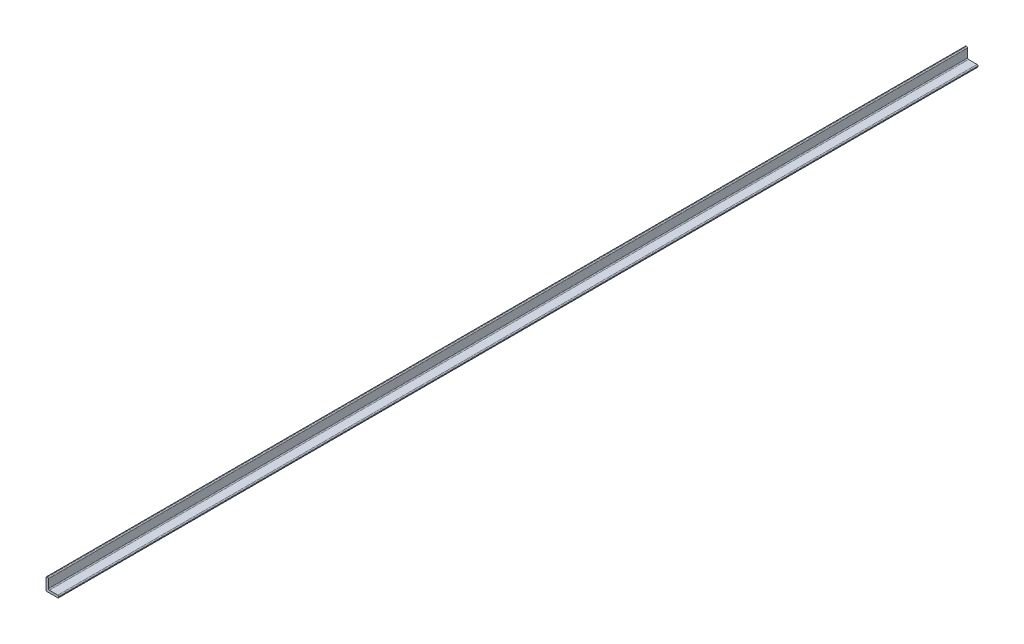
ISO-10303-21;
HEADER;
FILE_DESCRIPTION(('STEP AP214'),'2;1');
FILE_NAME('part.step','',(''),(''),'','','');
FILE_SCHEMA(('AUTOMOTIVE_DESIGN { 1 0 10303 214 1 1 1 1 }'));
ENDSEC;
DATA;
#1=APPLICATION_CONTEXT('core data for automotive mechanical design processes');
#2=APPLICATION_PROTOCOL_DEFINITION('international standard','automotive_design',2000,#1);
#3=PRODUCT_CONTEXT('',#1,'mechanical');
#4=PRODUCT('Part','Part','',(#3));
#5=PRODUCT_RELATED_PRODUCT_CATEGORY('part','',(#4));
#6=PRODUCT_DEFINITION_FORMATION('','',#4);
#7=PRODUCT_DEFINITION_CONTEXT('part definition',#1,'design');
#8=PRODUCT_DEFINITION('design','',#6,#7);
#9=PRODUCT_DEFINITION_SHAPE('','',#8);
#10=(LENGTH_UNIT() NAMED_UNIT(*) SI_UNIT(.MILLI.,.METRE.));
#11=(NAMED_UNIT(*) PLANE_ANGLE_UNIT() SI_UNIT($,.RADIAN.));
#12=(NAMED_UNIT(*) SI_UNIT($,.STERADIAN.) SOLID_ANGLE_UNIT());
#13=UNCERTAINTY_MEASURE_WITH_UNIT(LENGTH_MEASURE(1.E-05),#10,'distance_accuracy_value','');
#14=(GEOMETRIC_REPRESENTATION_CONTEXT(3) GLOBAL_UNCERTAINTY_ASSIGNED_CONTEXT((#13)) GLOBAL_UNIT_ASSIGNED_CONTEXT((#10,
#11,#12)) REPRESENTATION_CONTEXT('',''));
#15=CARTESIAN_POINT('',(0.,0.,0.));
#16=DIRECTION('',(0.,0.,1.));
#17=DIRECTION('',(1.,0.,0.));
#18=AXIS2_PLACEMENT_3D('',#15,#16,#17);
#19=CARTESIAN_POINT('',(-7.9375,12.7,-914.4));
#20=DIRECTION('',(0.,1.,0.));
#21=DIRECTION('',(0.,0.,1.));
#22=AXIS2_PLACEMENT_3D('',#19,#20,#21);
#23=PLANE('',#22);
#24=DIRECTION('',(-1.,0.,0.));
#25=VECTOR('',#24,1.);
#26=CARTESIAN_POINT('',(-7.9375,12.7,-914.4));
#27=LINE('',#26,#25);
#28=CARTESIAN_POINT('',(-9.8425,12.7,-914.4));
#29=VERTEX_POINT('',#28);
#30=CARTESIAN_POINT('',(-10.795,12.7,-914.4));
#31=VERTEX_POINT('',#30);
#32=EDGE_CURVE('E155',#29,#31,#27,.T.);
#33=ORIENTED_EDGE('',*,*,#32,.T.);
#34=DIRECTION('',(0.,0.,1.));
#35=VECTOR('',#34,1.);
#36=CARTESIAN_POINT('',(-10.795,12.7,-914.4));
#37=LINE('',#36,#35);
#38=CARTESIAN_POINT('',(-10.795,12.7,914.4));
#39=VERTEX_POINT('',#38);
#40=EDGE_CURVE('E45',#31,#39,#37,.T.);
#41=ORIENTED_EDGE('',*,*,#40,.T.);
#42=DIRECTION('',(-1.,0.,0.));
#43=VECTOR('',#42,1.);
#44=CARTESIAN_POINT('',(-7.9375,12.7,914.4));
#45=LINE('',#44,#43);
#46=CARTESIAN_POINT('',(-9.8425,12.7,914.4));
#47=VERTEX_POINT('',#46);
#48=EDGE_CURVE('E215',#47,#39,#45,.T.);
#49=ORIENTED_EDGE('',*,*,#48,.F.);
#50=DIRECTION('',(0.,0.,1.));
#51=VECTOR('',#50,1.);
#52=CARTESIAN_POINT('',(-9.8425,12.7,-914.4));
#53=LINE('',#52,#51);
#54=EDGE_CURVE('E209',#47,#29,#53,.F.);
#55=ORIENTED_EDGE('',*,*,#54,.T.);
#56=EDGE_LOOP('',(#33,#41,#49,#55));
#57=FACE_BOUND('',#56,.T.);
#58=ADVANCED_FACE('F37',(#57),#23,.T.);
#59=CARTESIAN_POINT('',(-7.9375,-6.0325,-914.4));
#60=DIRECTION('',(1.,0.,0.));
#61=DIRECTION('',(0.,0.,-1.));
#62=AXIS2_PLACEMENT_3D('',#59,#60,#61);
#63=PLANE('',#62);
#64=DIRECTION('',(0.,1.,0.));
#65=VECTOR('',#64,1.);
#66=CARTESIAN_POINT('',(-7.9375,-6.0325,-914.4));
#67=LINE('',#66,#65);
#68=CARTESIAN_POINT('',(-7.9375,-6.0325,-914.4));
#69=VERTEX_POINT('',#68);
#70=CARTESIAN_POINT('',(-7.9375,10.795,-914.4));
#71=VERTEX_POINT('',#70);
#72=EDGE_CURVE('E150',#69,#71,#67,.T.);
#73=ORIENTED_EDGE('',*,*,#72,.T.);
#74=DIRECTION('',(0.,0.,1.));
#75=VECTOR('',#74,1.);
#76=CARTESIAN_POINT('',(-7.9375,10.795,-914.4));
#77=LINE('',#76,#75);
#78=CARTESIAN_POINT('',(-7.9375,10.795,914.4));
#79=VERTEX_POINT('',#78);
#80=EDGE_CURVE('E11',#71,#79,#77,.T.);
#81=ORIENTED_EDGE('',*,*,#80,.T.);
#82=DIRECTION('',(0.,1.,0.));
#83=VECTOR('',#82,1.);
#84=CARTESIAN_POINT('',(-7.9375,-6.0325,914.4));
#85=LINE('',#84,#83);
#86=CARTESIAN_POINT('',(-7.9375,-6.0325,914.4));
#87=VERTEX_POINT('',#86);
#88=EDGE_CURVE('E153',#87,#79,#85,.T.);
#89=ORIENTED_EDGE('',*,*,#88,.F.);
#90=DIRECTION('',(0.,0.,1.));
#91=VECTOR('',#90,1.);
#92=CARTESIAN_POINT('',(-7.9375,-6.0325,-914.4));
#93=LINE('',#92,#91);
#94=EDGE_CURVE('E149',#69,#87,#93,.T.);
#95=ORIENTED_EDGE('',*,*,#94,.F.);
#96=EDGE_LOOP('',(#73,#81,#89,#95));
#97=FACE_BOUND('',#96,.T.);
#98=ADVANCED_FACE('F253',(#97),#63,.T.);
#99=CARTESIAN_POINT('',(-6.0325,-6.0325,-914.4));
#100=DIRECTION('',(0.,0.,1.));
#101=DIRECTION('',(1.,0.,0.));
#102=AXIS2_PLACEMENT_3D('',#99,#100,#101);
#103=CYLINDRICAL_SURFACE('',#102,1.905);
#104=ORIENTED_EDGE('',*,*,#94,.T.);
#105=CARTESIAN_POINT('',(-6.0325,-6.0325,914.4));
#106=DIRECTION('',(0.,0.,-1.));
#107=DIRECTION('',(1.,0.,0.));
#108=AXIS2_PLACEMENT_3D('',#105,#106,#107);
#109=CIRCLE('',#108,1.905);
#110=CARTESIAN_POINT('',(-6.0325,-7.9375,914.4));
#111=VERTEX_POINT('',#110);
#112=EDGE_CURVE('E134',#111,#87,#109,.T.);
#113=ORIENTED_EDGE('',*,*,#112,.F.);
#114=DIRECTION('',(0.,0.,1.));
#115=VECTOR('',#114,1.);
#116=CARTESIAN_POINT('',(-6.0325,-7.9375,-914.4));
#117=LINE('',#116,#115);
#118=CARTESIAN_POINT('',(-6.0325,-7.9375,-914.4));
#119=VERTEX_POINT('',#118);
#120=EDGE_CURVE('E143',#119,#111,#117,.T.);
#121=ORIENTED_EDGE('',*,*,#120,.F.);
#122=CARTESIAN_POINT('',(-6.0325,-6.0325,-914.4));
#123=DIRECTION('',(0.,0.,-1.));
#124=DIRECTION('',(1.,0.,0.));
#125=AXIS2_PLACEMENT_3D('',#122,#123,#124);
#126=CIRCLE('',#125,1.905);
#127=EDGE_CURVE('E170',#119,#69,#126,.T.);
#128=ORIENTED_EDGE('',*,*,#127,.T.);
#129=EDGE_LOOP('',(#104,#113,#121,#128));
#130=FACE_BOUND('',#129,.T.);
#131=ADVANCED_FACE('F152',(#130),#103,.F.);
#132=CARTESIAN_POINT('',(12.7,-7.9375,-914.4));
#133=DIRECTION('',(0.,1.,0.));
#134=DIRECTION('',(0.,0.,1.));
#135=AXIS2_PLACEMENT_3D('',#132,#133,#134);
#136=PLANE('',#135);
#137=DIRECTION('',(-1.,0.,0.));
#138=VECTOR('',#137,1.);
#139=CARTESIAN_POINT('',(12.7,-7.9375,914.4));
#140=LINE('',#139,#138);
#141=CARTESIAN_POINT('',(10.795,-7.9375,914.4));
#142=VERTEX_POINT('',#141);
#143=EDGE_CURVE('E128',#142,#111,#140,.T.);
#144=ORIENTED_EDGE('',*,*,#143,.F.);
#145=DIRECTION('',(0.,0.,1.));
#146=VECTOR('',#145,1.);
#147=CARTESIAN_POINT('',(10.795,-7.9375,-914.4));
#148=LINE('',#147,#146);
#149=CARTESIAN_POINT('',(10.795,-7.9375,-914.4));
#150=VERTEX_POINT('',#149);
#151=EDGE_CURVE('E207',#142,#150,#148,.F.);
#152=ORIENTED_EDGE('',*,*,#151,.T.);
#153=DIRECTION('',(-1.,0.,0.));
#154=VECTOR('',#153,1.);
#155=CARTESIAN_POINT('',(12.7,-7.9375,-914.4));
#156=LINE('',#155,#154);
#157=EDGE_CURVE('E145',#150,#119,#156,.T.);
#158=ORIENTED_EDGE('',*,*,#157,.T.);
#159=ORIENTED_EDGE('',*,*,#120,.T.);
#160=EDGE_LOOP('',(#144,#152,#158,#159));
#161=FACE_BOUND('',#160,.T.);
#162=ADVANCED_FACE('F144',(#161),#136,.T.);
#163=CARTESIAN_POINT('',(12.7,-12.7,-914.4));
#164=DIRECTION('',(1.,0.,0.));
#165=DIRECTION('',(0.,1.,0.));
#166=AXIS2_PLACEMENT_3D('',#163,#164,#165);
#167=PLANE('',#166);
#168=DIRECTION('',(0.,1.,0.));
#169=VECTOR('',#168,1.);
#170=CARTESIAN_POINT('',(12.7,-12.7,914.4));
#171=LINE('',#170,#169);
#172=CARTESIAN_POINT('',(12.7,-10.795,914.4));
#173=VERTEX_POINT('',#172);
#174=CARTESIAN_POINT('',(12.7,-9.8425,914.4));
#175=VERTEX_POINT('',#174);
#176=EDGE_CURVE('E140',#173,#175,#171,.T.);
#177=ORIENTED_EDGE('',*,*,#176,.F.);
#178=DIRECTION('',(0.,0.,1.));
#179=VECTOR('',#178,1.);
#180=CARTESIAN_POINT('',(12.7,-10.795,-914.4));
#181=LINE('',#180,#179);
#182=CARTESIAN_POINT('',(12.7,-10.795,-914.4));
#183=VERTEX_POINT('',#182);
#184=EDGE_CURVE('E59',#173,#183,#181,.F.);
#185=ORIENTED_EDGE('',*,*,#184,.T.);
#186=DIRECTION('',(0.,1.,0.));
#187=VECTOR('',#186,1.);
#188=CARTESIAN_POINT('',(12.7,-12.7,-914.4));
#189=LINE('',#188,#187);
#190=CARTESIAN_POINT('',(12.7,-9.8425,-914.4));
#191=VERTEX_POINT('',#190);
#192=EDGE_CURVE('E167',#183,#191,#189,.T.);
#193=ORIENTED_EDGE('',*,*,#192,.T.);
#194=DIRECTION('',(0.,0.,1.));
#195=VECTOR('',#194,1.);
#196=CARTESIAN_POINT('',(12.7,-9.8425,-914.4));
#197=LINE('',#196,#195);
#198=EDGE_CURVE('E203',#191,#175,#197,.T.);
#199=ORIENTED_EDGE('',*,*,#198,.T.);
#200=EDGE_LOOP('',(#177,#185,#193,#199));
#201=FACE_BOUND('',#200,.T.);
#202=ADVANCED_FACE('F227',(#201),#167,.T.);
#203=CARTESIAN_POINT('',(-12.7,-12.7,-914.4));
#204=DIRECTION('',(0.,-1.,0.));
#205=DIRECTION('',(0.,0.,-1.));
#206=AXIS2_PLACEMENT_3D('',#203,#204,#205);
#207=PLANE('',#206);
#208=DIRECTION('',(1.,0.,0.));
#209=VECTOR('',#208,1.);
#210=CARTESIAN_POINT('',(-12.7,-12.7,914.4));
#211=LINE('',#210,#209);
#212=CARTESIAN_POINT('',(-10.795,-12.7,914.4));
#213=VERTEX_POINT('',#212);
#214=CARTESIAN_POINT('',(10.795,-12.7,914.4));
#215=VERTEX_POINT('',#214);
#216=EDGE_CURVE('E223',#213,#215,#211,.T.);
#217=ORIENTED_EDGE('',*,*,#216,.F.);
#218=DIRECTION('',(0.,0.,1.));
#219=VECTOR('',#218,1.);
#220=CARTESIAN_POINT('',(-10.795,-12.7,-914.4));
#221=LINE('',#220,#219);
#222=CARTESIAN_POINT('',(-10.795,-12.7,-914.4));
#223=VERTEX_POINT('',#222);
#224=EDGE_CURVE('E192',#213,#223,#221,.F.);
#225=ORIENTED_EDGE('',*,*,#224,.T.);
#226=DIRECTION('',(1.,0.,0.));
#227=VECTOR('',#226,1.);
#228=CARTESIAN_POINT('',(-12.7,-12.7,-914.4));
#229=LINE('',#228,#227);
#230=CARTESIAN_POINT('',(10.795,-12.7,-914.4));
#231=VERTEX_POINT('',#230);
#232=EDGE_CURVE('E164',#223,#231,#229,.T.);
#233=ORIENTED_EDGE('',*,*,#232,.T.);
#234=DIRECTION('',(0.,0.,1.));
#235=VECTOR('',#234,1.);
#236=CARTESIAN_POINT('',(10.795,-12.7,-914.4));
#237=LINE('',#236,#235);
#238=EDGE_CURVE('E189',#231,#215,#237,.T.);
#239=ORIENTED_EDGE('',*,*,#238,.T.);
#240=EDGE_LOOP('',(#217,#225,#233,#239));
#241=FACE_BOUND('',#240,.T.);
#242=ADVANCED_FACE('F238',(#241),#207,.T.);
#243=CARTESIAN_POINT('',(-12.7,12.7,-914.4));
#244=DIRECTION('',(-1.,0.,0.));
#245=DIRECTION('',(0.,-1.,0.));
#246=AXIS2_PLACEMENT_3D('',#243,#244,#245);
#247=PLANE('',#246);
#248=DIRECTION('',(0.,-1.,0.));
#249=VECTOR('',#248,1.);
#250=CARTESIAN_POINT('',(-12.7,12.7,-914.4));
#251=LINE('',#250,#249);
#252=CARTESIAN_POINT('',(-12.7,10.795,-914.4));
#253=VERTEX_POINT('',#252);
#254=CARTESIAN_POINT('',(-12.7,-10.795,-914.4));
#255=VERTEX_POINT('',#254);
#256=EDGE_CURVE('E161',#253,#255,#251,.T.);
#257=ORIENTED_EDGE('',*,*,#256,.T.);
#258=DIRECTION('',(0.,0.,1.));
#259=VECTOR('',#258,1.);
#260=CARTESIAN_POINT('',(-12.7,-10.795,-914.4));
#261=LINE('',#260,#259);
#262=CARTESIAN_POINT('',(-12.7,-10.795,914.4));
#263=VERTEX_POINT('',#262);
#264=EDGE_CURVE('E177',#255,#263,#261,.T.);
#265=ORIENTED_EDGE('',*,*,#264,.T.);
#266=DIRECTION('',(0.,-1.,0.));
#267=VECTOR('',#266,1.);
#268=CARTESIAN_POINT('',(-12.7,12.7,914.4));
#269=LINE('',#268,#267);
#270=CARTESIAN_POINT('',(-12.7,10.795,914.4));
#271=VERTEX_POINT('',#270);
#272=EDGE_CURVE('E221',#271,#263,#269,.T.);
#273=ORIENTED_EDGE('',*,*,#272,.F.);
#274=DIRECTION('',(0.,0.,1.));
#275=VECTOR('',#274,1.);
#276=CARTESIAN_POINT('',(-12.7,10.795,-914.4));
#277=LINE('',#276,#275);
#278=EDGE_CURVE('E174',#271,#253,#277,.F.);
#279=ORIENTED_EDGE('',*,*,#278,.T.);
#280=EDGE_LOOP('',(#257,#265,#273,#279));
#281=FACE_BOUND('',#280,.T.);
#282=ADVANCED_FACE('F245',(#281),#247,.T.);
#283=CARTESIAN_POINT('',(-6.0325,-6.0325,-914.4));
#284=DIRECTION('',(0.,0.,1.));
#285=DIRECTION('',(1.,0.,0.));
#286=AXIS2_PLACEMENT_3D('',#283,#284,#285);
#287=PLANE('',#286);
#288=ORIENTED_EDGE('',*,*,#232,.F.);
#289=CARTESIAN_POINT('',(-10.795,-10.795,-914.4));
#290=DIRECTION('',(0.,0.,1.));
#291=DIRECTION('',(1.,0.,0.));
#292=AXIS2_PLACEMENT_3D('',#289,#290,#291);
#293=CIRCLE('',#292,1.905);
#294=EDGE_CURVE('E201',#223,#255,#293,.F.);
#295=ORIENTED_EDGE('',*,*,#294,.T.);
#296=ORIENTED_EDGE('',*,*,#256,.F.);
#297=CARTESIAN_POINT('',(-10.795,10.795,-914.4));
#298=DIRECTION('',(0.,0.,1.));
#299=DIRECTION('',(1.,0.,0.));
#300=AXIS2_PLACEMENT_3D('',#297,#298,#299);
#301=CIRCLE('',#300,1.905);
#302=EDGE_CURVE('E196',#253,#31,#301,.F.);
#303=ORIENTED_EDGE('',*,*,#302,.T.);
#304=ORIENTED_EDGE('',*,*,#32,.F.);
#305=CARTESIAN_POINT('',(-9.8425,10.795,-914.4));
#306=DIRECTION('',(0.,0.,1.));
#307=DIRECTION('',(1.,0.,0.));
#308=AXIS2_PLACEMENT_3D('',#305,#306,#307);
#309=CIRCLE('',#308,1.905);
#310=EDGE_CURVE('E194',#29,#71,#309,.F.);
#311=ORIENTED_EDGE('',*,*,#310,.T.);
#312=ORIENTED_EDGE('',*,*,#72,.F.);
#313=ORIENTED_EDGE('',*,*,#127,.F.);
#314=ORIENTED_EDGE('',*,*,#157,.F.);
#315=CARTESIAN_POINT('',(10.795,-9.8425,-914.4));
#316=DIRECTION('',(0.,0.,1.));
#317=DIRECTION('',(1.,0.,0.));
#318=AXIS2_PLACEMENT_3D('',#315,#316,#317);
#319=CIRCLE('',#318,1.905);
#320=EDGE_CURVE('E52',#150,#191,#319,.F.);
#321=ORIENTED_EDGE('',*,*,#320,.T.);
#322=ORIENTED_EDGE('',*,*,#192,.F.);
#323=CARTESIAN_POINT('',(10.795,-10.795,-914.4));
#324=DIRECTION('',(0.,0.,1.));
#325=DIRECTION('',(1.,0.,0.));
#326=AXIS2_PLACEMENT_3D('',#323,#324,#325);
#327=CIRCLE('',#326,1.905);
#328=EDGE_CURVE('E199',#183,#231,#327,.F.);
#329=ORIENTED_EDGE('',*,*,#328,.T.);
#330=EDGE_LOOP('',(#288,#295,#296,#303,#304,#311,#312,#313,#314,#321,#322,#329));
#331=FACE_BOUND('',#330,.T.);
#332=ADVANCED_FACE('F234',(#331),#287,.F.);
#333=CARTESIAN_POINT('',(-6.0325,-6.0325,914.4));
#334=DIRECTION('',(0.,0.,1.));
#335=DIRECTION('',(1.,0.,0.));
#336=AXIS2_PLACEMENT_3D('',#333,#334,#335);
#337=PLANE('',#336);
#338=ORIENTED_EDGE('',*,*,#272,.T.);
#339=CARTESIAN_POINT('',(-10.795,-10.795,914.4));
#340=DIRECTION('',(0.,0.,1.));
#341=DIRECTION('',(1.,0.,0.));
#342=AXIS2_PLACEMENT_3D('',#339,#340,#341);
#343=CIRCLE('',#342,1.905);
#344=EDGE_CURVE('E187',#263,#213,#343,.T.);
#345=ORIENTED_EDGE('',*,*,#344,.T.);
#346=ORIENTED_EDGE('',*,*,#216,.T.);
#347=CARTESIAN_POINT('',(10.795,-10.795,914.4));
#348=DIRECTION('',(0.,0.,1.));
#349=DIRECTION('',(1.,0.,0.));
#350=AXIS2_PLACEMENT_3D('',#347,#348,#349);
#351=CIRCLE('',#350,1.905);
#352=EDGE_CURVE('E185',#215,#173,#351,.T.);
#353=ORIENTED_EDGE('',*,*,#352,.T.);
#354=ORIENTED_EDGE('',*,*,#176,.T.);
#355=CARTESIAN_POINT('',(10.795,-9.8425,914.4));
#356=DIRECTION('',(0.,0.,1.));
#357=DIRECTION('',(1.,0.,0.));
#358=AXIS2_PLACEMENT_3D('',#355,#356,#357);
#359=CIRCLE('',#358,1.905);
#360=EDGE_CURVE('E137',#175,#142,#359,.T.);
#361=ORIENTED_EDGE('',*,*,#360,.T.);
#362=ORIENTED_EDGE('',*,*,#143,.T.);
#363=ORIENTED_EDGE('',*,*,#112,.T.);
#364=ORIENTED_EDGE('',*,*,#88,.T.);
#365=CARTESIAN_POINT('',(-9.8425,10.795,914.4));
#366=DIRECTION('',(0.,0.,1.));
#367=DIRECTION('',(1.,0.,0.));
#368=AXIS2_PLACEMENT_3D('',#365,#366,#367);
#369=CIRCLE('',#368,1.905);
#370=EDGE_CURVE('E180',#79,#47,#369,.T.);
#371=ORIENTED_EDGE('',*,*,#370,.T.);
#372=ORIENTED_EDGE('',*,*,#48,.T.);
#373=CARTESIAN_POINT('',(-10.795,10.795,914.4));
#374=DIRECTION('',(0.,0.,1.));
#375=DIRECTION('',(1.,0.,0.));
#376=AXIS2_PLACEMENT_3D('',#373,#374,#375);
#377=CIRCLE('',#376,1.905);
#378=EDGE_CURVE('E182',#39,#271,#377,.T.);
#379=ORIENTED_EDGE('',*,*,#378,.T.);
#380=EDGE_LOOP('',(#338,#345,#346,#353,#354,#361,#362,#363,#364,#371,#372,#379));
#381=FACE_BOUND('',#380,.T.);
#382=ADVANCED_FACE('F131',(#381),#337,.T.);
#383=CARTESIAN_POINT('',(-10.795,-10.795,-914.4));
#384=DIRECTION('',(0.,0.,1.));
#385=DIRECTION('',(1.,0.,0.));
#386=AXIS2_PLACEMENT_3D('',#383,#384,#385);
#387=CYLINDRICAL_SURFACE('',#386,1.905);
#388=ORIENTED_EDGE('',*,*,#294,.F.);
#389=ORIENTED_EDGE('',*,*,#224,.F.);
#390=ORIENTED_EDGE('',*,*,#344,.F.);
#391=ORIENTED_EDGE('',*,*,#264,.F.);
#392=EDGE_LOOP('',(#388,#389,#390,#391));
#393=FACE_BOUND('',#392,.T.);
#394=ADVANCED_FACE('F241',(#393),#387,.T.);
#395=CARTESIAN_POINT('',(10.795,-10.795,-914.4));
#396=DIRECTION('',(0.,0.,1.));
#397=DIRECTION('',(1.,0.,0.));
#398=AXIS2_PLACEMENT_3D('',#395,#396,#397);
#399=CYLINDRICAL_SURFACE('',#398,1.905);
#400=ORIENTED_EDGE('',*,*,#328,.F.);
#401=ORIENTED_EDGE('',*,*,#184,.F.);
#402=ORIENTED_EDGE('',*,*,#352,.F.);
#403=ORIENTED_EDGE('',*,*,#238,.F.);
#404=EDGE_LOOP('',(#400,#401,#402,#403));
#405=FACE_BOUND('',#404,.T.);
#406=ADVANCED_FACE('F231',(#405),#399,.T.);
#407=CARTESIAN_POINT('',(10.795,-9.8425,-914.4));
#408=DIRECTION('',(0.,0.,1.));
#409=DIRECTION('',(1.,0.,0.));
#410=AXIS2_PLACEMENT_3D('',#407,#408,#409);
#411=CYLINDRICAL_SURFACE('',#410,1.905);
#412=ORIENTED_EDGE('',*,*,#320,.F.);
#413=ORIENTED_EDGE('',*,*,#151,.F.);
#414=ORIENTED_EDGE('',*,*,#360,.F.);
#415=ORIENTED_EDGE('',*,*,#198,.F.);
#416=EDGE_LOOP('',(#412,#413,#414,#415));
#417=FACE_BOUND('',#416,.T.);
#418=ADVANCED_FACE('F255',(#417),#411,.T.);
#419=CARTESIAN_POINT('',(-10.795,10.795,-914.4));
#420=DIRECTION('',(0.,0.,1.));
#421=DIRECTION('',(1.,0.,0.));
#422=AXIS2_PLACEMENT_3D('',#419,#420,#421);
#423=CYLINDRICAL_SURFACE('',#422,1.905);
#424=ORIENTED_EDGE('',*,*,#302,.F.);
#425=ORIENTED_EDGE('',*,*,#278,.F.);
#426=ORIENTED_EDGE('',*,*,#378,.F.);
#427=ORIENTED_EDGE('',*,*,#40,.F.);
#428=EDGE_LOOP('',(#424,#425,#426,#427));
#429=FACE_BOUND('',#428,.T.);
#430=ADVANCED_FACE('F247',(#429),#423,.T.);
#431=CARTESIAN_POINT('',(-9.8425,10.795,-914.4));
#432=DIRECTION('',(0.,0.,1.));
#433=DIRECTION('',(1.,0.,0.));
#434=AXIS2_PLACEMENT_3D('',#431,#432,#433);
#435=CYLINDRICAL_SURFACE('',#434,1.905);
#436=ORIENTED_EDGE('',*,*,#310,.F.);
#437=ORIENTED_EDGE('',*,*,#54,.F.);
#438=ORIENTED_EDGE('',*,*,#370,.F.);
#439=ORIENTED_EDGE('',*,*,#80,.F.);
#440=EDGE_LOOP('',(#436,#437,#438,#439));
#441=FACE_BOUND('',#440,.T.);
#442=ADVANCED_FACE('F39',(#441),#435,.T.);
#443=CLOSED_SHELL('',(#58,#98,#131,#162,#202,#242,#282,#332,#382,#394,#406,#418,#430,#442));
#444=MANIFOLD_SOLID_BREP('B2',#443);
#445=ADVANCED_BREP_SHAPE_REPRESENTATION('',(#18,#444),#14);
#446=SHAPE_DEFINITION_REPRESENTATION(#9,#445);
ENDSEC;
END-ISO-10303-21;
